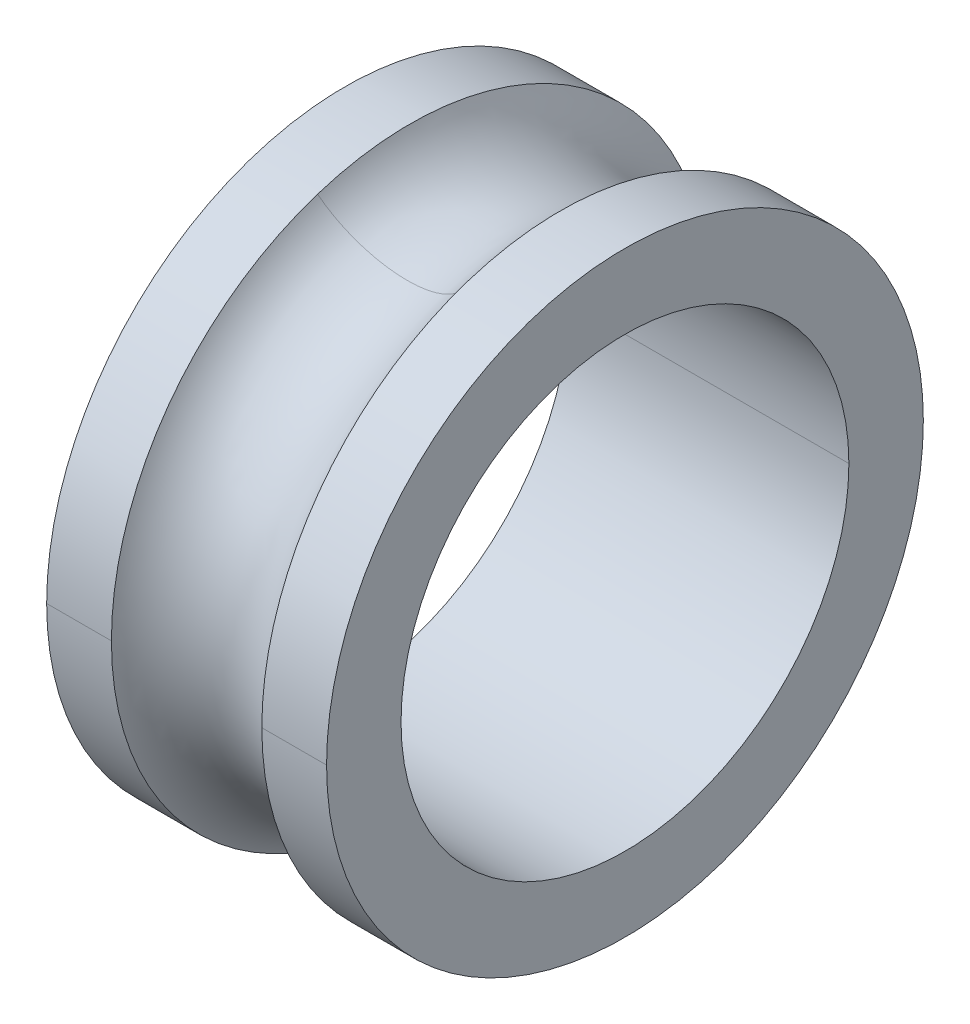
ISO-10303-21;
HEADER;
FILE_DESCRIPTION(('STEP AP214'),'2;1');
FILE_NAME('part.step','',(''),(''),'','','');
FILE_SCHEMA(('AUTOMOTIVE_DESIGN { 1 0 10303 214 1 1 1 1 }'));
ENDSEC;
DATA;
#1=APPLICATION_CONTEXT('core data for automotive mechanical design processes');
#2=APPLICATION_PROTOCOL_DEFINITION('international standard','automotive_design',2000,#1);
#3=PRODUCT_CONTEXT('',#1,'mechanical');
#4=PRODUCT('Part','Part','',(#3));
#5=PRODUCT_RELATED_PRODUCT_CATEGORY('part','',(#4));
#6=PRODUCT_DEFINITION_FORMATION('','',#4);
#7=PRODUCT_DEFINITION_CONTEXT('part definition',#1,'design');
#8=PRODUCT_DEFINITION('design','',#6,#7);
#9=PRODUCT_DEFINITION_SHAPE('','',#8);
#10=(LENGTH_UNIT() NAMED_UNIT(*) SI_UNIT(.MILLI.,.METRE.));
#11=(NAMED_UNIT(*) PLANE_ANGLE_UNIT() SI_UNIT($,.RADIAN.));
#12=(NAMED_UNIT(*) SI_UNIT($,.STERADIAN.) SOLID_ANGLE_UNIT());
#13=UNCERTAINTY_MEASURE_WITH_UNIT(LENGTH_MEASURE(1.E-05),#10,'distance_accuracy_value','');
#14=(GEOMETRIC_REPRESENTATION_CONTEXT(3) GLOBAL_UNCERTAINTY_ASSIGNED_CONTEXT((#13)) GLOBAL_UNIT_ASSIGNED_CONTEXT((#10,
#11,#12)) REPRESENTATION_CONTEXT('',''));
#15=CARTESIAN_POINT('',(0.,0.,0.));
#16=DIRECTION('',(0.,0.,1.));
#17=DIRECTION('',(1.,0.,0.));
#18=AXIS2_PLACEMENT_3D('',#15,#16,#17);
#19=CARTESIAN_POINT('',(2.5,0.,0.));
#20=DIRECTION('',(1.,0.,0.));
#21=DIRECTION('',(0.,1.,0.));
#22=AXIS2_PLACEMENT_3D('',#19,#20,#21);
#23=CYLINDRICAL_SURFACE('',#22,5.33);
#24=DIRECTION('',(1.,0.,0.));
#25=VECTOR('',#24,1.);
#26=CARTESIAN_POINT('',(1.34329585348872,0.,5.33));
#27=LINE('',#26,#25);
#28=CARTESIAN_POINT('',(1.34329585348872,0.,5.33));
#29=VERTEX_POINT('',#28);
#30=CARTESIAN_POINT('',(2.5,0.,5.33));
#31=VERTEX_POINT('',#30);
#32=EDGE_CURVE('E11',#29,#31,#27,.T.);
#33=ORIENTED_EDGE('',*,*,#32,.F.);
#34=CARTESIAN_POINT('',(1.34329585348872,0.,0.));
#35=DIRECTION('',(-1.,0.,0.));
#36=DIRECTION('',(0.,0.,1.));
#37=AXIS2_PLACEMENT_3D('',#34,#35,#36);
#38=CIRCLE('',#37,5.33);
#39=CARTESIAN_POINT('',(1.34329585348872,-5.06913123185317,-1.64706058001847));
#40=VERTEX_POINT('',#39);
#41=EDGE_CURVE('E25',#40,#29,#38,.T.);
#42=ORIENTED_EDGE('',*,*,#41,.F.);
#43=CARTESIAN_POINT('',(1.34329585348872,0.,0.));
#44=DIRECTION('',(-1.,0.,0.));
#45=DIRECTION('',(0.,0.,1.));
#46=AXIS2_PLACEMENT_3D('',#43,#44,#45);
#47=CIRCLE('',#46,5.33);
#48=CARTESIAN_POINT('',(1.34329585348872,0.,-5.33));
#49=VERTEX_POINT('',#48);
#50=EDGE_CURVE('E187',#49,#40,#47,.T.);
#51=ORIENTED_EDGE('',*,*,#50,.F.);
#52=DIRECTION('',(1.,0.,0.));
#53=VECTOR('',#52,1.);
#54=CARTESIAN_POINT('',(1.34329585348872,0.,-5.33));
#55=LINE('',#54,#53);
#56=CARTESIAN_POINT('',(2.5,0.,-5.33));
#57=VERTEX_POINT('',#56);
#58=EDGE_CURVE('E93',#49,#57,#55,.T.);
#59=ORIENTED_EDGE('',*,*,#58,.T.);
#60=CARTESIAN_POINT('',(2.5,0.,0.));
#61=DIRECTION('',(1.,0.,0.));
#62=DIRECTION('',(0.,0.,-1.));
#63=AXIS2_PLACEMENT_3D('',#60,#61,#62);
#64=CIRCLE('',#63,5.33);
#65=EDGE_CURVE('E179',#31,#57,#64,.T.);
#66=ORIENTED_EDGE('',*,*,#65,.F.);
#67=EDGE_LOOP('',(#33,#42,#51,#59,#66));
#68=FACE_BOUND('',#67,.T.);
#69=ADVANCED_FACE('F17',(#68),#23,.T.);
#70=CARTESIAN_POINT('',(2.5,4.,0.));
#71=DIRECTION('',(1.,0.,0.));
#72=DIRECTION('',(0.,0.,-1.));
#73=AXIS2_PLACEMENT_3D('',#70,#71,#72);
#74=PLANE('',#73);
#75=CARTESIAN_POINT('',(2.5,0.,0.));
#76=DIRECTION('',(1.,0.,0.));
#77=DIRECTION('',(0.,0.,-1.));
#78=AXIS2_PLACEMENT_3D('',#75,#76,#77);
#79=CIRCLE('',#78,5.33);
#80=EDGE_CURVE('E174',#57,#31,#79,.T.);
#81=ORIENTED_EDGE('',*,*,#80,.T.);
#82=ORIENTED_EDGE('',*,*,#65,.T.);
#83=EDGE_LOOP('',(#81,#82));
#84=FACE_BOUND('',#83,.T.);
#85=CARTESIAN_POINT('',(2.5,0.,0.));
#86=DIRECTION('',(1.,0.,0.));
#87=DIRECTION('',(0.,0.,-1.));
#88=AXIS2_PLACEMENT_3D('',#85,#86,#87);
#89=CIRCLE('',#88,4.);
#90=CARTESIAN_POINT('',(2.5,0.,4.));
#91=VERTEX_POINT('',#90);
#92=CARTESIAN_POINT('',(2.5,0.,-4.));
#93=VERTEX_POINT('',#92);
#94=EDGE_CURVE('E169',#91,#93,#89,.T.);
#95=ORIENTED_EDGE('',*,*,#94,.F.);
#96=CARTESIAN_POINT('',(2.5,0.,0.));
#97=DIRECTION('',(1.,0.,0.));
#98=DIRECTION('',(0.,0.,-1.));
#99=AXIS2_PLACEMENT_3D('',#96,#97,#98);
#100=CIRCLE('',#99,4.);
#101=EDGE_CURVE('E164',#93,#91,#100,.T.);
#102=ORIENTED_EDGE('',*,*,#101,.F.);
#103=EDGE_LOOP('',(#95,#102));
#104=FACE_BOUND('',#103,.T.);
#105=ADVANCED_FACE('F218',(#84,#104),#74,.T.);
#106=CARTESIAN_POINT('',(2.5,0.,0.));
#107=DIRECTION('',(1.,0.,0.));
#108=DIRECTION('',(0.,-1.,0.));
#109=AXIS2_PLACEMENT_3D('',#106,#107,#108);
#110=CYLINDRICAL_SURFACE('',#109,4.);
#111=DIRECTION('',(1.,0.,0.));
#112=VECTOR('',#111,1.);
#113=CARTESIAN_POINT('',(-2.5,0.,4.));
#114=LINE('',#113,#112);
#115=CARTESIAN_POINT('',(-2.5,0.,4.));
#116=VERTEX_POINT('',#115);
#117=EDGE_CURVE('E159',#116,#91,#114,.T.);
#118=ORIENTED_EDGE('',*,*,#117,.F.);
#119=CARTESIAN_POINT('',(-2.5,0.,0.));
#120=DIRECTION('',(1.,0.,0.));
#121=DIRECTION('',(0.,0.,-1.));
#122=AXIS2_PLACEMENT_3D('',#119,#120,#121);
#123=CIRCLE('',#122,4.);
#124=CARTESIAN_POINT('',(-2.5,0.,-4.));
#125=VERTEX_POINT('',#124);
#126=EDGE_CURVE('E154',#125,#116,#123,.T.);
#127=ORIENTED_EDGE('',*,*,#126,.F.);
#128=DIRECTION('',(1.,0.,0.));
#129=VECTOR('',#128,1.);
#130=CARTESIAN_POINT('',(-2.5,0.,-4.));
#131=LINE('',#130,#129);
#132=EDGE_CURVE('E149',#125,#93,#131,.T.);
#133=ORIENTED_EDGE('',*,*,#132,.T.);
#134=ORIENTED_EDGE('',*,*,#101,.T.);
#135=EDGE_LOOP('',(#118,#127,#133,#134));
#136=FACE_BOUND('',#135,.T.);
#137=ADVANCED_FACE('F214',(#136),#110,.F.);
#138=CARTESIAN_POINT('',(2.5,0.,0.));
#139=DIRECTION('',(1.,0.,0.));
#140=DIRECTION('',(0.,1.,0.));
#141=AXIS2_PLACEMENT_3D('',#138,#139,#140);
#142=CYLINDRICAL_SURFACE('',#141,4.);
#143=ORIENTED_EDGE('',*,*,#117,.T.);
#144=ORIENTED_EDGE('',*,*,#94,.T.);
#145=ORIENTED_EDGE('',*,*,#132,.F.);
#146=CARTESIAN_POINT('',(-2.5,0.,0.));
#147=DIRECTION('',(1.,0.,0.));
#148=DIRECTION('',(0.,0.,-1.));
#149=AXIS2_PLACEMENT_3D('',#146,#147,#148);
#150=CIRCLE('',#149,4.);
#151=EDGE_CURVE('E144',#116,#125,#150,.T.);
#152=ORIENTED_EDGE('',*,*,#151,.F.);
#153=EDGE_LOOP('',(#143,#144,#145,#152));
#154=FACE_BOUND('',#153,.T.);
#155=ADVANCED_FACE('F205',(#154),#142,.F.);
#156=CARTESIAN_POINT('',(-2.5,5.33,0.));
#157=DIRECTION('',(-1.,0.,0.));
#158=DIRECTION('',(0.,0.,1.));
#159=AXIS2_PLACEMENT_3D('',#156,#157,#158);
#160=PLANE('',#159);
#161=ORIENTED_EDGE('',*,*,#126,.T.);
#162=ORIENTED_EDGE('',*,*,#151,.T.);
#163=EDGE_LOOP('',(#161,#162));
#164=FACE_BOUND('',#163,.T.);
#165=CARTESIAN_POINT('',(-2.5,0.,0.));
#166=DIRECTION('',(1.,0.,0.));
#167=DIRECTION('',(0.,0.,-1.));
#168=AXIS2_PLACEMENT_3D('',#165,#166,#167);
#169=CIRCLE('',#168,5.33);
#170=CARTESIAN_POINT('',(-2.5,0.,5.33));
#171=VERTEX_POINT('',#170);
#172=CARTESIAN_POINT('',(-2.5,0.,-5.33));
#173=VERTEX_POINT('',#172);
#174=EDGE_CURVE('E139',#171,#173,#169,.T.);
#175=ORIENTED_EDGE('',*,*,#174,.F.);
#176=CARTESIAN_POINT('',(-2.5,0.,0.));
#177=DIRECTION('',(1.,0.,0.));
#178=DIRECTION('',(0.,0.,-1.));
#179=AXIS2_PLACEMENT_3D('',#176,#177,#178);
#180=CIRCLE('',#179,5.33);
#181=EDGE_CURVE('E134',#173,#171,#180,.T.);
#182=ORIENTED_EDGE('',*,*,#181,.F.);
#183=EDGE_LOOP('',(#175,#182));
#184=FACE_BOUND('',#183,.T.);
#185=ADVANCED_FACE('F203',(#164,#184),#160,.T.);
#186=CARTESIAN_POINT('',(2.5,0.,0.));
#187=DIRECTION('',(1.,0.,0.));
#188=DIRECTION('',(0.,-1.,0.));
#189=AXIS2_PLACEMENT_3D('',#186,#187,#188);
#190=CYLINDRICAL_SURFACE('',#189,5.33);
#191=DIRECTION('',(1.,0.,0.));
#192=VECTOR('',#191,1.);
#193=CARTESIAN_POINT('',(-2.5,0.,5.33));
#194=LINE('',#193,#192);
#195=CARTESIAN_POINT('',(-1.34329585348872,0.,5.33));
#196=VERTEX_POINT('',#195);
#197=EDGE_CURVE('E130',#171,#196,#194,.T.);
#198=ORIENTED_EDGE('',*,*,#197,.T.);
#199=CARTESIAN_POINT('',(-1.34329585348872,0.,0.));
#200=DIRECTION('',(1.,0.,0.));
#201=DIRECTION('',(0.,0.,-1.));
#202=AXIS2_PLACEMENT_3D('',#199,#200,#201);
#203=CIRCLE('',#202,5.33);
#204=CARTESIAN_POINT('',(-1.34329585348872,5.06913123185317,1.64706058001847));
#205=VERTEX_POINT('',#204);
#206=EDGE_CURVE('E126',#205,#196,#203,.T.);
#207=ORIENTED_EDGE('',*,*,#206,.F.);
#208=CARTESIAN_POINT('',(-1.34329585348872,0.,0.));
#209=DIRECTION('',(1.,0.,0.));
#210=DIRECTION('',(0.,0.,-1.));
#211=AXIS2_PLACEMENT_3D('',#208,#209,#210);
#212=CIRCLE('',#211,5.33);
#213=CARTESIAN_POINT('',(-1.34329585348872,0.,-5.33));
#214=VERTEX_POINT('',#213);
#215=EDGE_CURVE('E99',#214,#205,#212,.T.);
#216=ORIENTED_EDGE('',*,*,#215,.F.);
#217=DIRECTION('',(1.,0.,0.));
#218=VECTOR('',#217,1.);
#219=CARTESIAN_POINT('',(-2.5,0.,-5.33));
#220=LINE('',#219,#218);
#221=EDGE_CURVE('E118',#173,#214,#220,.T.);
#222=ORIENTED_EDGE('',*,*,#221,.F.);
#223=ORIENTED_EDGE('',*,*,#181,.T.);
#224=EDGE_LOOP('',(#198,#207,#216,#222,#223));
#225=FACE_BOUND('',#224,.T.);
#226=ADVANCED_FACE('F201',(#225),#190,.T.);
#227=CARTESIAN_POINT('',(2.5,0.,0.));
#228=DIRECTION('',(1.,0.,0.));
#229=DIRECTION('',(0.,1.,0.));
#230=AXIS2_PLACEMENT_3D('',#227,#228,#229);
#231=CYLINDRICAL_SURFACE('',#230,5.33);
#232=ORIENTED_EDGE('',*,*,#197,.F.);
#233=ORIENTED_EDGE('',*,*,#174,.T.);
#234=ORIENTED_EDGE('',*,*,#221,.T.);
#235=CARTESIAN_POINT('',(-1.34329585348872,0.,0.));
#236=DIRECTION('',(1.,0.,0.));
#237=DIRECTION('',(0.,0.,-1.));
#238=AXIS2_PLACEMENT_3D('',#235,#236,#237);
#239=CIRCLE('',#238,5.33);
#240=CARTESIAN_POINT('',(-1.34329585348872,-5.06913123185317,-1.64706058001847));
#241=VERTEX_POINT('',#240);
#242=EDGE_CURVE('E114',#241,#214,#239,.T.);
#243=ORIENTED_EDGE('',*,*,#242,.F.);
#244=CARTESIAN_POINT('',(-1.34329585348872,0.,0.));
#245=DIRECTION('',(1.,0.,0.));
#246=DIRECTION('',(0.,0.,-1.));
#247=AXIS2_PLACEMENT_3D('',#244,#245,#246);
#248=CIRCLE('',#247,5.33);
#249=EDGE_CURVE('E109',#196,#241,#248,.T.);
#250=ORIENTED_EDGE('',*,*,#249,.F.);
#251=EDGE_LOOP('',(#232,#233,#234,#243,#250));
#252=FACE_BOUND('',#251,.T.);
#253=ADVANCED_FACE('F198',(#252),#231,.T.);
#254=CARTESIAN_POINT('',(0.,0.,0.));
#255=DIRECTION('',(1.,0.,0.));
#256=DIRECTION('',(0.,0.309016994374947,-0.951056516295154));
#257=AXIS2_PLACEMENT_3D('',#254,#255,#256);
#258=TOROIDAL_SURFACE('',#257,5.9975,1.5);
#259=CARTESIAN_POINT('',(0.,-5.70396145648018,-1.85332942376375));
#260=DIRECTION('',(0.,0.309016994374947,-0.951056516295154));
#261=DIRECTION('',(-0.895530568992482,0.423220149751346,0.137512562496852));
#262=AXIS2_PLACEMENT_3D('',#259,#260,#261);
#263=CIRCLE('',#262,1.5);
#264=EDGE_CURVE('E86',#241,#40,#263,.T.);
#265=ORIENTED_EDGE('',*,*,#264,.T.);
#266=ORIENTED_EDGE('',*,*,#41,.T.);
#267=CARTESIAN_POINT('',(1.34329585348872,0.,0.));
#268=DIRECTION('',(-1.,0.,0.));
#269=DIRECTION('',(0.,0.,1.));
#270=AXIS2_PLACEMENT_3D('',#267,#268,#269);
#271=CIRCLE('',#270,5.33);
#272=CARTESIAN_POINT('',(1.34329585348872,5.06913123185317,1.64706058001847));
#273=VERTEX_POINT('',#272);
#274=EDGE_CURVE('E77',#29,#273,#271,.T.);
#275=ORIENTED_EDGE('',*,*,#274,.T.);
#276=CARTESIAN_POINT('',(0.,5.70396145648018,1.85332942376375));
#277=DIRECTION('',(0.,-0.309016994374947,0.951056516295154));
#278=DIRECTION('',(-0.895530568992482,-0.423220149751344,-0.137512562496852));
#279=AXIS2_PLACEMENT_3D('',#276,#277,#278);
#280=CIRCLE('',#279,1.5);
#281=EDGE_CURVE('E83',#205,#273,#280,.T.);
#282=ORIENTED_EDGE('',*,*,#281,.F.);
#283=ORIENTED_EDGE('',*,*,#206,.T.);
#284=ORIENTED_EDGE('',*,*,#249,.T.);
#285=EDGE_LOOP('',(#265,#266,#275,#282,#283,#284));
#286=FACE_BOUND('',#285,.T.);
#287=ADVANCED_FACE('F80',(#286),#258,.F.);
#288=CARTESIAN_POINT('',(0.,0.,0.));
#289=DIRECTION('',(1.,0.,0.));
#290=DIRECTION('',(0.,-0.309016994374947,0.951056516295154));
#291=AXIS2_PLACEMENT_3D('',#288,#289,#290);
#292=TOROIDAL_SURFACE('',#291,5.9975,1.5);
#293=ORIENTED_EDGE('',*,*,#264,.F.);
#294=ORIENTED_EDGE('',*,*,#242,.T.);
#295=ORIENTED_EDGE('',*,*,#215,.T.);
#296=ORIENTED_EDGE('',*,*,#281,.T.);
#297=CARTESIAN_POINT('',(1.34329585348872,0.,0.));
#298=DIRECTION('',(-1.,0.,0.));
#299=DIRECTION('',(0.,0.,1.));
#300=AXIS2_PLACEMENT_3D('',#297,#298,#299);
#301=CIRCLE('',#300,5.33);
#302=EDGE_CURVE('E90',#273,#49,#301,.T.);
#303=ORIENTED_EDGE('',*,*,#302,.T.);
#304=ORIENTED_EDGE('',*,*,#50,.T.);
#305=EDGE_LOOP('',(#293,#294,#295,#296,#303,#304));
#306=FACE_BOUND('',#305,.T.);
#307=ADVANCED_FACE('F97',(#306),#292,.F.);
#308=CARTESIAN_POINT('',(2.5,0.,0.));
#309=DIRECTION('',(1.,0.,0.));
#310=DIRECTION('',(0.,-1.,0.));
#311=AXIS2_PLACEMENT_3D('',#308,#309,#310);
#312=CYLINDRICAL_SURFACE('',#311,5.33);
#313=ORIENTED_EDGE('',*,*,#32,.T.);
#314=ORIENTED_EDGE('',*,*,#80,.F.);
#315=ORIENTED_EDGE('',*,*,#58,.F.);
#316=ORIENTED_EDGE('',*,*,#302,.F.);
#317=ORIENTED_EDGE('',*,*,#274,.F.);
#318=EDGE_LOOP('',(#313,#314,#315,#316,#317));
#319=FACE_BOUND('',#318,.T.);
#320=ADVANCED_FACE('F91',(#319),#312,.T.);
#321=CLOSED_SHELL('',(#69,#105,#137,#155,#185,#226,#253,#287,#307,#320));
#322=MANIFOLD_SOLID_BREP('B1',#321);
#323=ADVANCED_BREP_SHAPE_REPRESENTATION('',(#18,#322),#14);
#324=SHAPE_DEFINITION_REPRESENTATION(#9,#323);
ENDSEC;
END-ISO-10303-21;
